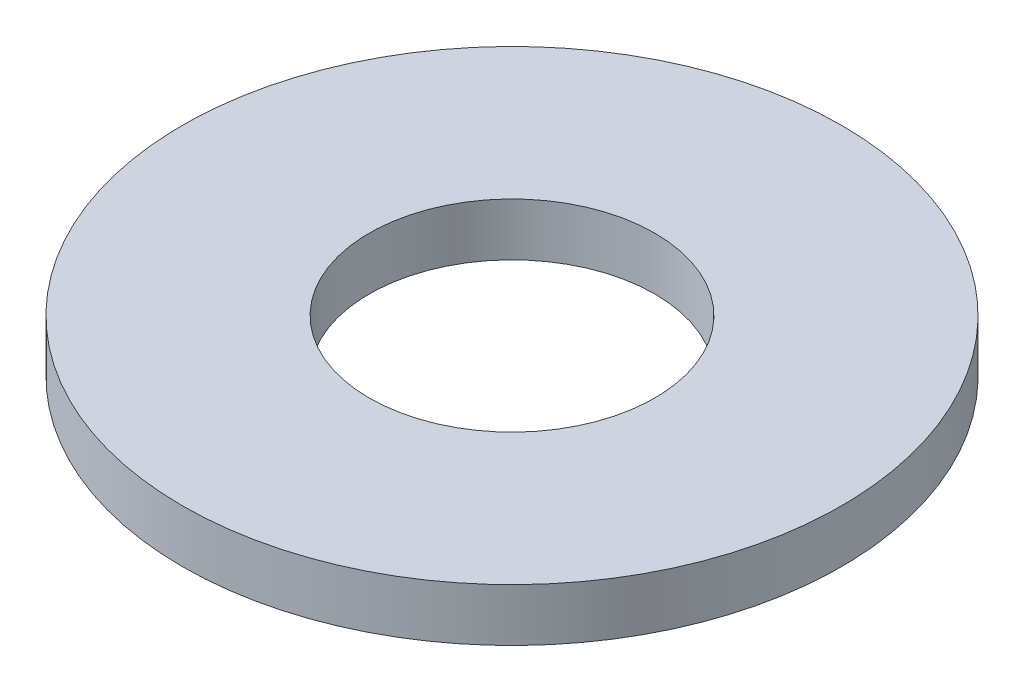
ISO-10303-21;
HEADER;
FILE_DESCRIPTION(('STEP AP214'),'2;1');
FILE_NAME('part.step','',(''),(''),'','','');
FILE_SCHEMA(('AUTOMOTIVE_DESIGN { 1 0 10303 214 1 1 1 1 }'));
ENDSEC;
DATA;
#1=APPLICATION_CONTEXT('core data for automotive mechanical design processes');
#2=APPLICATION_PROTOCOL_DEFINITION('international standard','automotive_design',2000,#1);
#3=PRODUCT_CONTEXT('',#1,'mechanical');
#4=PRODUCT('Part','Part','',(#3));
#5=PRODUCT_RELATED_PRODUCT_CATEGORY('part','',(#4));
#6=PRODUCT_DEFINITION_FORMATION('','',#4);
#7=PRODUCT_DEFINITION_CONTEXT('part definition',#1,'design');
#8=PRODUCT_DEFINITION('design','',#6,#7);
#9=PRODUCT_DEFINITION_SHAPE('','',#8);
#10=(LENGTH_UNIT() NAMED_UNIT(*) SI_UNIT(.MILLI.,.METRE.));
#11=(NAMED_UNIT(*) PLANE_ANGLE_UNIT() SI_UNIT($,.RADIAN.));
#12=(NAMED_UNIT(*) SI_UNIT($,.STERADIAN.) SOLID_ANGLE_UNIT());
#13=UNCERTAINTY_MEASURE_WITH_UNIT(LENGTH_MEASURE(1.E-05),#10,'distance_accuracy_value','');
#14=(GEOMETRIC_REPRESENTATION_CONTEXT(3) GLOBAL_UNCERTAINTY_ASSIGNED_CONTEXT((#13)) GLOBAL_UNIT_ASSIGNED_CONTEXT((#10,
#11,#12)) REPRESENTATION_CONTEXT('',''));
#15=CARTESIAN_POINT('',(0.,0.,0.));
#16=DIRECTION('',(0.,0.,1.));
#17=DIRECTION('',(1.,0.,0.));
#18=AXIS2_PLACEMENT_3D('',#15,#16,#17);
#19=CARTESIAN_POINT('',(0.,12.,0.));
#20=DIRECTION('',(0.,-1.,0.));
#21=DIRECTION('',(0.,0.,-1.));
#22=AXIS2_PLACEMENT_3D('',#19,#20,#21);
#23=CYLINDRICAL_SURFACE('',#22,75.);
#24=CARTESIAN_POINT('',(0.,12.,0.));
#25=DIRECTION('',(0.,1.,0.));
#26=DIRECTION('',(0.,0.,1.));
#27=AXIS2_PLACEMENT_3D('',#24,#25,#26);
#28=CIRCLE('',#27,75.);
#29=CARTESIAN_POINT('',(0.,12.,75.));
#30=VERTEX_POINT('',#29);
#31=EDGE_CURVE('E10',#30,#30,#28,.T.);
#32=ORIENTED_EDGE('',*,*,#31,.F.);
#33=EDGE_LOOP('',(#32));
#34=FACE_BOUND('',#33,.T.);
#35=CARTESIAN_POINT('',(0.,0.,0.));
#36=DIRECTION('',(0.,1.,0.));
#37=DIRECTION('',(0.,0.,1.));
#38=AXIS2_PLACEMENT_3D('',#35,#36,#37);
#39=CIRCLE('',#38,75.);
#40=CARTESIAN_POINT('',(0.,0.,75.));
#41=VERTEX_POINT('',#40);
#42=EDGE_CURVE('E37',#41,#41,#39,.T.);
#43=ORIENTED_EDGE('',*,*,#42,.T.);
#44=EDGE_LOOP('',(#43));
#45=FACE_BOUND('',#44,.T.);
#46=ADVANCED_FACE('F40',(#34,#45),#23,.T.);
#47=CARTESIAN_POINT('',(0.,12.,0.));
#48=DIRECTION('',(0.,1.,0.));
#49=DIRECTION('',(0.,0.,1.));
#50=AXIS2_PLACEMENT_3D('',#47,#48,#49);
#51=PLANE('',#50);
#52=CARTESIAN_POINT('',(0.,12.,0.));
#53=DIRECTION('',(0.,1.,0.));
#54=DIRECTION('',(0.,0.,1.));
#55=AXIS2_PLACEMENT_3D('',#52,#53,#54);
#56=CIRCLE('',#55,32.5);
#57=CARTESIAN_POINT('',(0.,12.,32.5));
#58=VERTEX_POINT('',#57);
#59=EDGE_CURVE('E50',#58,#58,#56,.T.);
#60=ORIENTED_EDGE('',*,*,#59,.F.);
#61=EDGE_LOOP('',(#60));
#62=FACE_BOUND('',#61,.T.);
#63=ORIENTED_EDGE('',*,*,#31,.T.);
#64=EDGE_LOOP('',(#63));
#65=FACE_BOUND('',#64,.T.);
#66=ADVANCED_FACE('F59',(#62,#65),#51,.T.);
#67=CARTESIAN_POINT('',(0.,0.,0.));
#68=DIRECTION('',(0.,1.,0.));
#69=DIRECTION('',(0.,0.,1.));
#70=AXIS2_PLACEMENT_3D('',#67,#68,#69);
#71=PLANE('',#70);
#72=CARTESIAN_POINT('',(0.,0.,0.));
#73=DIRECTION('',(0.,1.,0.));
#74=DIRECTION('',(0.,0.,1.));
#75=AXIS2_PLACEMENT_3D('',#72,#73,#74);
#76=CIRCLE('',#75,32.5);
#77=CARTESIAN_POINT('',(0.,0.,32.5));
#78=VERTEX_POINT('',#77);
#79=EDGE_CURVE('E47',#78,#78,#76,.T.);
#80=ORIENTED_EDGE('',*,*,#79,.T.);
#81=EDGE_LOOP('',(#80));
#82=FACE_BOUND('',#81,.T.);
#83=ORIENTED_EDGE('',*,*,#42,.F.);
#84=EDGE_LOOP('',(#83));
#85=FACE_BOUND('',#84,.T.);
#86=ADVANCED_FACE('F58',(#82,#85),#71,.F.);
#87=CARTESIAN_POINT('',(0.,12.,0.));
#88=DIRECTION('',(0.,-1.,0.));
#89=DIRECTION('',(0.,0.,-1.));
#90=AXIS2_PLACEMENT_3D('',#87,#88,#89);
#91=CYLINDRICAL_SURFACE('',#90,32.5);
#92=ORIENTED_EDGE('',*,*,#59,.T.);
#93=EDGE_LOOP('',(#92));
#94=FACE_BOUND('',#93,.T.);
#95=ORIENTED_EDGE('',*,*,#79,.F.);
#96=EDGE_LOOP('',(#95));
#97=FACE_BOUND('',#96,.T.);
#98=ADVANCED_FACE('F54',(#94,#97),#91,.F.);
#99=CLOSED_SHELL('',(#46,#66,#86,#98));
#100=MANIFOLD_SOLID_BREP('B2',#99);
#101=ADVANCED_BREP_SHAPE_REPRESENTATION('',(#18,#100),#14);
#102=SHAPE_DEFINITION_REPRESENTATION(#9,#101);
ENDSEC;
END-ISO-10303-21;
